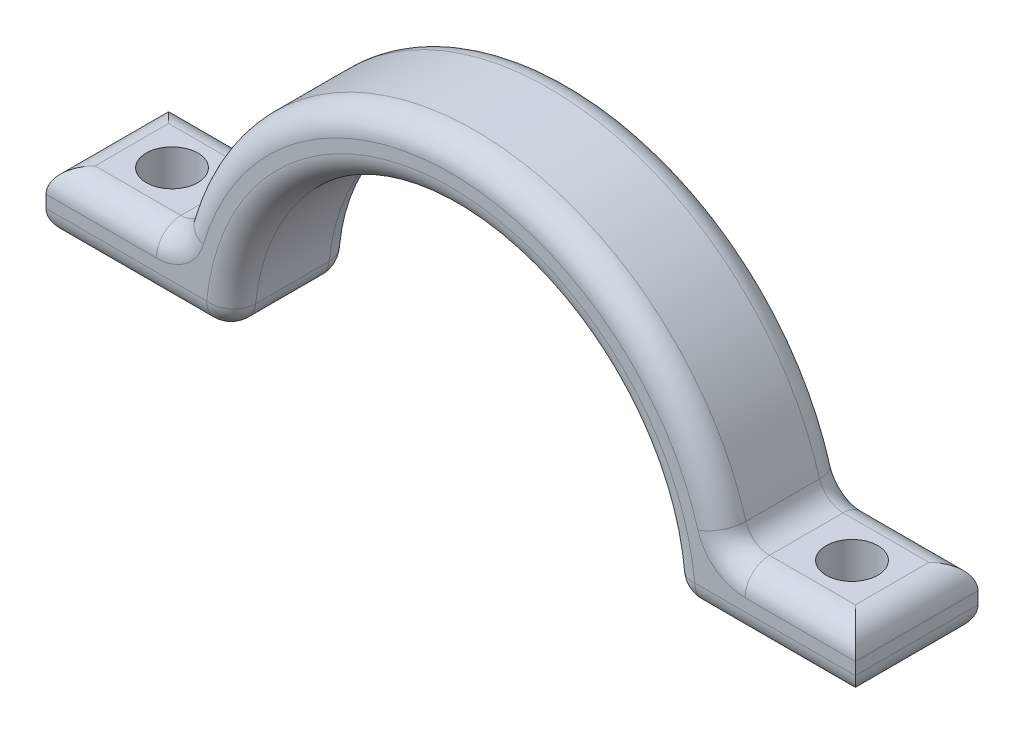
ISO-10303-21;
HEADER;
FILE_DESCRIPTION(('STEP AP214'),'2;1');
FILE_NAME('part.step','',(''),(''),'','','');
FILE_SCHEMA(('AUTOMOTIVE_DESIGN { 1 0 10303 214 1 1 1 1 }'));
ENDSEC;
DATA;
#1=APPLICATION_CONTEXT('core data for automotive mechanical design processes');
#2=APPLICATION_PROTOCOL_DEFINITION('international standard','automotive_design',2000,#1);
#3=PRODUCT_CONTEXT('',#1,'mechanical');
#4=PRODUCT('Part','Part','',(#3));
#5=PRODUCT_RELATED_PRODUCT_CATEGORY('part','',(#4));
#6=PRODUCT_DEFINITION_FORMATION('','',#4);
#7=PRODUCT_DEFINITION_CONTEXT('part definition',#1,'design');
#8=PRODUCT_DEFINITION('design','',#6,#7);
#9=PRODUCT_DEFINITION_SHAPE('','',#8);
#10=(LENGTH_UNIT() NAMED_UNIT(*) SI_UNIT(.MILLI.,.METRE.));
#11=(NAMED_UNIT(*) PLANE_ANGLE_UNIT() SI_UNIT($,.RADIAN.));
#12=(NAMED_UNIT(*) SI_UNIT($,.STERADIAN.) SOLID_ANGLE_UNIT());
#13=UNCERTAINTY_MEASURE_WITH_UNIT(LENGTH_MEASURE(1.E-05),#10,'distance_accuracy_value','');
#14=(GEOMETRIC_REPRESENTATION_CONTEXT(3) GLOBAL_UNCERTAINTY_ASSIGNED_CONTEXT((#13)) GLOBAL_UNIT_ASSIGNED_CONTEXT((#10,
#11,#12)) REPRESENTATION_CONTEXT('',''));
#15=CARTESIAN_POINT('',(0.,0.,0.));
#16=DIRECTION('',(0.,0.,1.));
#17=DIRECTION('',(1.,0.,0.));
#18=AXIS2_PLACEMENT_3D('',#15,#16,#17);
#19=CARTESIAN_POINT('',(0.,0.,10.));
#20=DIRECTION('',(0.,0.,-1.));
#21=DIRECTION('',(-1.,0.,0.));
#22=AXIS2_PLACEMENT_3D('',#19,#20,#21);
#23=CYLINDRICAL_SURFACE('',#22,23.);
#24=CARTESIAN_POINT('',(0.,0.,8.));
#25=DIRECTION('',(0.,0.,1.));
#26=DIRECTION('',(1.,0.,0.));
#27=AXIS2_PLACEMENT_3D('',#24,#25,#26);
#28=CIRCLE('',#27,23.);
#29=CARTESIAN_POINT('',(-22.08,6.44,8.));
#30=VERTEX_POINT('',#29);
#31=CARTESIAN_POINT('',(22.08,6.44,8.));
#32=VERTEX_POINT('',#31);
#33=EDGE_CURVE('E283',#30,#32,#28,.F.);
#34=ORIENTED_EDGE('',*,*,#33,.T.);
#35=DIRECTION('',(0.,0.,-1.));
#36=VECTOR('',#35,1.);
#37=CARTESIAN_POINT('',(22.08,6.44,10.));
#38=LINE('',#37,#36);
#39=CARTESIAN_POINT('',(22.08,6.44,2.));
#40=VERTEX_POINT('',#39);
#41=EDGE_CURVE('E286',#32,#40,#38,.T.);
#42=ORIENTED_EDGE('',*,*,#41,.T.);
#43=CARTESIAN_POINT('',(0.,0.,2.));
#44=DIRECTION('',(0.,0.,1.));
#45=DIRECTION('',(1.,0.,0.));
#46=AXIS2_PLACEMENT_3D('',#43,#44,#45);
#47=CIRCLE('',#46,23.);
#48=CARTESIAN_POINT('',(-22.08,6.44,2.));
#49=VERTEX_POINT('',#48);
#50=EDGE_CURVE('E281',#40,#49,#47,.T.);
#51=ORIENTED_EDGE('',*,*,#50,.T.);
#52=DIRECTION('',(0.,0.,-1.));
#53=VECTOR('',#52,1.);
#54=CARTESIAN_POINT('',(-22.08,6.44,10.));
#55=LINE('',#54,#53);
#56=EDGE_CURVE('E279',#49,#30,#55,.F.);
#57=ORIENTED_EDGE('',*,*,#56,.T.);
#58=EDGE_LOOP('',(#34,#42,#51,#57));
#59=FACE_BOUND('',#58,.T.);
#60=ADVANCED_FACE('F35',(#59),#23,.T.);
#61=CARTESIAN_POINT('',(-23.,0.,10.));
#62=DIRECTION('',(0.,1.,0.));
#63=DIRECTION('',(0.,0.,1.));
#64=AXIS2_PLACEMENT_3D('',#61,#62,#63);
#65=PLANE('',#64);
#66=DIRECTION('',(1.,0.,0.));
#67=VECTOR('',#66,1.);
#68=CARTESIAN_POINT('',(-23.,0.,2.));
#69=LINE('',#68,#67);
#70=CARTESIAN_POINT('',(-31.,0.,2.));
#71=VERTEX_POINT('',#70);
#72=CARTESIAN_POINT('',(-19.8997487421324,0.,2.));
#73=VERTEX_POINT('',#72);
#74=EDGE_CURVE('E274',#71,#73,#69,.T.);
#75=ORIENTED_EDGE('',*,*,#74,.T.);
#76=DIRECTION('',(0.,0.,-1.));
#77=VECTOR('',#76,1.);
#78=CARTESIAN_POINT('',(-19.8997487421324,0.,10.));
#79=LINE('',#78,#77);
#80=CARTESIAN_POINT('',(-19.8997487421324,0.,8.));
#81=VERTEX_POINT('',#80);
#82=EDGE_CURVE('E277',#73,#81,#79,.F.);
#83=ORIENTED_EDGE('',*,*,#82,.T.);
#84=DIRECTION('',(1.,0.,0.));
#85=VECTOR('',#84,1.);
#86=CARTESIAN_POINT('',(-33.,0.,8.));
#87=LINE('',#86,#85);
#88=CARTESIAN_POINT('',(-31.,0.,8.));
#89=VERTEX_POINT('',#88);
#90=EDGE_CURVE('E272',#81,#89,#87,.F.);
#91=ORIENTED_EDGE('',*,*,#90,.T.);
#92=DIRECTION('',(0.,0.,1.));
#93=VECTOR('',#92,1.);
#94=CARTESIAN_POINT('',(-31.,0.,0.));
#95=LINE('',#94,#93);
#96=EDGE_CURVE('E270',#89,#71,#95,.F.);
#97=ORIENTED_EDGE('',*,*,#96,.T.);
#98=EDGE_LOOP('',(#75,#83,#91,#97));
#99=FACE_BOUND('',#98,.T.);
#100=CARTESIAN_POINT('',(-27.7249721603218,0.,5.));
#101=DIRECTION('',(0.,1.,0.));
#102=DIRECTION('',(0.,0.,1.));
#103=AXIS2_PLACEMENT_3D('',#100,#101,#102);
#104=CIRCLE('',#103,2.1);
#105=CARTESIAN_POINT('',(-27.7249721603218,0.,7.1));
#106=VERTEX_POINT('',#105);
#107=EDGE_CURVE('E425',#106,#106,#104,.T.);
#108=ORIENTED_EDGE('',*,*,#107,.T.);
#109=EDGE_LOOP('',(#108));
#110=FACE_BOUND('',#109,.T.);
#111=ADVANCED_FACE('F395',(#99,#110),#65,.F.);
#112=CARTESIAN_POINT('',(0.,0.,10.));
#113=DIRECTION('',(0.,0.,-1.));
#114=DIRECTION('',(-1.,0.,0.));
#115=AXIS2_PLACEMENT_3D('',#112,#113,#114);
#116=CYLINDRICAL_SURFACE('',#115,18.);
#117=CARTESIAN_POINT('',(0.,0.,2.));
#118=DIRECTION('',(0.,0.,1.));
#119=DIRECTION('',(1.,0.,0.));
#120=AXIS2_PLACEMENT_3D('',#117,#118,#119);
#121=CIRCLE('',#120,18.);
#122=CARTESIAN_POINT('',(-17.9097738679192,1.8,2.));
#123=VERTEX_POINT('',#122);
#124=CARTESIAN_POINT('',(17.9097738679192,1.8,2.));
#125=VERTEX_POINT('',#124);
#126=EDGE_CURVE('E292',#123,#125,#121,.F.);
#127=ORIENTED_EDGE('',*,*,#126,.T.);
#128=DIRECTION('',(0.,0.,-1.));
#129=VECTOR('',#128,1.);
#130=CARTESIAN_POINT('',(17.9097738679192,1.8,10.));
#131=LINE('',#130,#129);
#132=CARTESIAN_POINT('',(17.9097738679192,1.8,8.));
#133=VERTEX_POINT('',#132);
#134=EDGE_CURVE('E52',#125,#133,#131,.F.);
#135=ORIENTED_EDGE('',*,*,#134,.T.);
#136=CARTESIAN_POINT('',(0.,0.,8.));
#137=DIRECTION('',(0.,0.,1.));
#138=DIRECTION('',(1.,0.,0.));
#139=AXIS2_PLACEMENT_3D('',#136,#137,#138);
#140=CIRCLE('',#139,18.);
#141=CARTESIAN_POINT('',(-17.9097738679192,1.8,8.));
#142=VERTEX_POINT('',#141);
#143=EDGE_CURVE('E290',#133,#142,#140,.T.);
#144=ORIENTED_EDGE('',*,*,#143,.T.);
#145=DIRECTION('',(0.,0.,-1.));
#146=VECTOR('',#145,1.);
#147=CARTESIAN_POINT('',(-17.9097738679192,1.8,10.));
#148=LINE('',#147,#146);
#149=EDGE_CURVE('E288',#142,#123,#148,.T.);
#150=ORIENTED_EDGE('',*,*,#149,.T.);
#151=EDGE_LOOP('',(#127,#135,#144,#150));
#152=FACE_BOUND('',#151,.T.);
#153=ADVANCED_FACE('F456',(#152),#116,.F.);
#154=CARTESIAN_POINT('',(18.,0.,10.));
#155=DIRECTION('',(0.,1.,0.));
#156=DIRECTION('',(0.,0.,1.));
#157=AXIS2_PLACEMENT_3D('',#154,#155,#156);
#158=PLANE('',#157);
#159=DIRECTION('',(1.,0.,0.));
#160=VECTOR('',#159,1.);
#161=CARTESIAN_POINT('',(18.,0.,2.));
#162=LINE('',#161,#160);
#163=CARTESIAN_POINT('',(19.8997487421324,0.,2.));
#164=VERTEX_POINT('',#163);
#165=CARTESIAN_POINT('',(31.,0.,2.));
#166=VERTEX_POINT('',#165);
#167=EDGE_CURVE('E263',#164,#166,#162,.T.);
#168=ORIENTED_EDGE('',*,*,#167,.T.);
#169=DIRECTION('',(0.,0.,1.));
#170=VECTOR('',#169,1.);
#171=CARTESIAN_POINT('',(31.,0.,10.));
#172=LINE('',#171,#170);
#173=CARTESIAN_POINT('',(31.,0.,8.));
#174=VERTEX_POINT('',#173);
#175=EDGE_CURVE('E268',#166,#174,#172,.T.);
#176=ORIENTED_EDGE('',*,*,#175,.T.);
#177=DIRECTION('',(1.,0.,0.));
#178=VECTOR('',#177,1.);
#179=CARTESIAN_POINT('',(18.,0.,8.));
#180=LINE('',#179,#178);
#181=CARTESIAN_POINT('',(19.8997487421324,0.,8.));
#182=VERTEX_POINT('',#181);
#183=EDGE_CURVE('E265',#174,#182,#180,.F.);
#184=ORIENTED_EDGE('',*,*,#183,.T.);
#185=DIRECTION('',(0.,0.,-1.));
#186=VECTOR('',#185,1.);
#187=CARTESIAN_POINT('',(19.8997487421324,0.,10.));
#188=LINE('',#187,#186);
#189=EDGE_CURVE('E261',#182,#164,#188,.T.);
#190=ORIENTED_EDGE('',*,*,#189,.T.);
#191=EDGE_LOOP('',(#168,#176,#184,#190));
#192=FACE_BOUND('',#191,.T.);
#193=CARTESIAN_POINT('',(27.7249721603218,0.,5.));
#194=DIRECTION('',(0.,1.,0.));
#195=DIRECTION('',(0.,0.,1.));
#196=AXIS2_PLACEMENT_3D('',#193,#194,#195);
#197=CIRCLE('',#196,2.1);
#198=CARTESIAN_POINT('',(27.7249721603218,0.,7.1));
#199=VERTEX_POINT('',#198);
#200=EDGE_CURVE('E440',#199,#199,#197,.F.);
#201=ORIENTED_EDGE('',*,*,#200,.F.);
#202=EDGE_LOOP('',(#201));
#203=FACE_BOUND('',#202,.T.);
#204=ADVANCED_FACE('F454',(#192,#203),#158,.F.);
#205=CARTESIAN_POINT('',(0.,0.,10.));
#206=DIRECTION('',(0.,0.,1.));
#207=DIRECTION('',(1.,0.,0.));
#208=AXIS2_PLACEMENT_3D('',#205,#206,#207);
#209=PLANE('',#208);
#210=DIRECTION('',(0.,1.,0.));
#211=VECTOR('',#210,1.);
#212=CARTESIAN_POINT('',(33.,0.,10.));
#213=LINE('',#212,#211);
#214=CARTESIAN_POINT('',(33.,2.,10.));
#215=VERTEX_POINT('',#214);
#216=CARTESIAN_POINT('',(33.,3.,10.));
#217=VERTEX_POINT('',#216);
#218=EDGE_CURVE('E438',#215,#217,#213,.T.);
#219=ORIENTED_EDGE('',*,*,#218,.T.);
#220=DIRECTION('',(1.,0.,0.));
#221=VECTOR('',#220,1.);
#222=CARTESIAN_POINT('',(22.4499443206436,3.,10.));
#223=LINE('',#222,#221);
#224=CARTESIAN_POINT('',(24.,3.,10.));
#225=VERTEX_POINT('',#224);
#226=EDGE_CURVE('E192',#217,#225,#223,.F.);
#227=ORIENTED_EDGE('',*,*,#226,.T.);
#228=CARTESIAN_POINT('',(24.,7.,10.));
#229=DIRECTION('',(0.,0.,1.));
#230=DIRECTION('',(1.,0.,0.));
#231=AXIS2_PLACEMENT_3D('',#228,#229,#230);
#232=CIRCLE('',#231,4.);
#233=CARTESIAN_POINT('',(20.16,5.88,10.));
#234=VERTEX_POINT('',#233);
#235=EDGE_CURVE('E230',#234,#225,#232,.T.);
#236=ORIENTED_EDGE('',*,*,#235,.F.);
#237=CARTESIAN_POINT('',(0.,0.,10.));
#238=DIRECTION('',(0.,0.,1.));
#239=DIRECTION('',(1.,0.,0.));
#240=AXIS2_PLACEMENT_3D('',#237,#238,#239);
#241=CIRCLE('',#240,21.);
#242=CARTESIAN_POINT('',(-20.16,5.88,10.));
#243=VERTEX_POINT('',#242);
#244=EDGE_CURVE('E226',#234,#243,#241,.T.);
#245=ORIENTED_EDGE('',*,*,#244,.T.);
#246=CARTESIAN_POINT('',(-24.,7.,10.));
#247=DIRECTION('',(0.,0.,1.));
#248=DIRECTION('',(1.,0.,0.));
#249=AXIS2_PLACEMENT_3D('',#246,#247,#248);
#250=CIRCLE('',#249,4.);
#251=CARTESIAN_POINT('',(-24.,3.,10.));
#252=VERTEX_POINT('',#251);
#253=EDGE_CURVE('E223',#252,#243,#250,.T.);
#254=ORIENTED_EDGE('',*,*,#253,.F.);
#255=DIRECTION('',(-1.,0.,0.));
#256=VECTOR('',#255,1.);
#257=CARTESIAN_POINT('',(0.,3.,10.));
#258=LINE('',#257,#256);
#259=CARTESIAN_POINT('',(-33.,3.,10.));
#260=VERTEX_POINT('',#259);
#261=EDGE_CURVE('E228',#252,#260,#258,.T.);
#262=ORIENTED_EDGE('',*,*,#261,.T.);
#263=DIRECTION('',(0.,1.,0.));
#264=VECTOR('',#263,1.);
#265=CARTESIAN_POINT('',(-33.,0.,10.));
#266=LINE('',#265,#264);
#267=CARTESIAN_POINT('',(-33.,2.,10.));
#268=VERTEX_POINT('',#267);
#269=EDGE_CURVE('E421',#268,#260,#266,.T.);
#270=ORIENTED_EDGE('',*,*,#269,.F.);
#271=DIRECTION('',(1.,0.,0.));
#272=VECTOR('',#271,1.);
#273=CARTESIAN_POINT('',(-18.,2.,10.));
#274=LINE('',#273,#272);
#275=CARTESIAN_POINT('',(-19.8997487421324,2.,10.));
#276=VERTEX_POINT('',#275);
#277=EDGE_CURVE('E218',#268,#276,#274,.T.);
#278=ORIENTED_EDGE('',*,*,#277,.T.);
#279=CARTESIAN_POINT('',(0.,0.,10.));
#280=DIRECTION('',(0.,0.,1.));
#281=DIRECTION('',(1.,0.,0.));
#282=AXIS2_PLACEMENT_3D('',#279,#280,#281);
#283=CIRCLE('',#282,20.);
#284=CARTESIAN_POINT('',(19.8997487421324,2.,10.));
#285=VERTEX_POINT('',#284);
#286=EDGE_CURVE('E213',#276,#285,#283,.F.);
#287=ORIENTED_EDGE('',*,*,#286,.T.);
#288=DIRECTION('',(1.,0.,0.));
#289=VECTOR('',#288,1.);
#290=CARTESIAN_POINT('',(33.,2.,10.));
#291=LINE('',#290,#289);
#292=EDGE_CURVE('E220',#285,#215,#291,.T.);
#293=ORIENTED_EDGE('',*,*,#292,.T.);
#294=EDGE_LOOP('',(#219,#227,#236,#245,#254,#262,#270,#278,#287,#293));
#295=FACE_BOUND('',#294,.T.);
#296=ADVANCED_FACE('F416',(#295),#209,.T.);
#297=CARTESIAN_POINT('',(0.,0.,0.));
#298=DIRECTION('',(0.,0.,1.));
#299=DIRECTION('',(1.,0.,0.));
#300=AXIS2_PLACEMENT_3D('',#297,#298,#299);
#301=PLANE('',#300);
#302=CARTESIAN_POINT('',(24.,7.,0.));
#303=DIRECTION('',(0.,0.,1.));
#304=DIRECTION('',(1.,0.,0.));
#305=AXIS2_PLACEMENT_3D('',#302,#303,#304);
#306=CIRCLE('',#305,4.);
#307=CARTESIAN_POINT('',(24.,3.,0.));
#308=VERTEX_POINT('',#307);
#309=CARTESIAN_POINT('',(20.16,5.88,0.));
#310=VERTEX_POINT('',#309);
#311=EDGE_CURVE('E249',#308,#310,#306,.F.);
#312=ORIENTED_EDGE('',*,*,#311,.F.);
#313=DIRECTION('',(1.,0.,0.));
#314=VECTOR('',#313,1.);
#315=CARTESIAN_POINT('',(0.,3.,0.));
#316=LINE('',#315,#314);
#317=CARTESIAN_POINT('',(33.,3.,0.));
#318=VERTEX_POINT('',#317);
#319=EDGE_CURVE('E259',#308,#318,#316,.T.);
#320=ORIENTED_EDGE('',*,*,#319,.T.);
#321=DIRECTION('',(0.,-1.,0.));
#322=VECTOR('',#321,1.);
#323=CARTESIAN_POINT('',(33.,0.,0.));
#324=LINE('',#323,#322);
#325=CARTESIAN_POINT('',(33.,2.,0.));
#326=VERTEX_POINT('',#325);
#327=EDGE_CURVE('E435',#318,#326,#324,.T.);
#328=ORIENTED_EDGE('',*,*,#327,.T.);
#329=DIRECTION('',(1.,0.,0.));
#330=VECTOR('',#329,1.);
#331=CARTESIAN_POINT('',(0.,2.,0.));
#332=LINE('',#331,#330);
#333=CARTESIAN_POINT('',(19.8997487421324,2.,0.));
#334=VERTEX_POINT('',#333);
#335=EDGE_CURVE('E247',#326,#334,#332,.F.);
#336=ORIENTED_EDGE('',*,*,#335,.T.);
#337=CARTESIAN_POINT('',(0.,0.,0.));
#338=DIRECTION('',(0.,0.,1.));
#339=DIRECTION('',(1.,0.,0.));
#340=AXIS2_PLACEMENT_3D('',#337,#338,#339);
#341=CIRCLE('',#340,20.);
#342=CARTESIAN_POINT('',(-19.8997487421324,2.,0.));
#343=VERTEX_POINT('',#342);
#344=EDGE_CURVE('E243',#334,#343,#341,.T.);
#345=ORIENTED_EDGE('',*,*,#344,.T.);
#346=DIRECTION('',(1.,0.,0.));
#347=VECTOR('',#346,1.);
#348=CARTESIAN_POINT('',(0.,2.,0.));
#349=LINE('',#348,#347);
#350=CARTESIAN_POINT('',(-33.,2.,0.));
#351=VERTEX_POINT('',#350);
#352=EDGE_CURVE('E245',#343,#351,#349,.F.);
#353=ORIENTED_EDGE('',*,*,#352,.T.);
#354=DIRECTION('',(0.,-1.,0.));
#355=VECTOR('',#354,1.);
#356=CARTESIAN_POINT('',(-33.,0.,0.));
#357=LINE('',#356,#355);
#358=CARTESIAN_POINT('',(-33.,3.,0.));
#359=VERTEX_POINT('',#358);
#360=EDGE_CURVE('E205',#359,#351,#357,.T.);
#361=ORIENTED_EDGE('',*,*,#360,.F.);
#362=DIRECTION('',(-1.,0.,0.));
#363=VECTOR('',#362,1.);
#364=CARTESIAN_POINT('',(-22.4499443206436,3.,0.));
#365=LINE('',#364,#363);
#366=CARTESIAN_POINT('',(-24.,3.,0.));
#367=VERTEX_POINT('',#366);
#368=EDGE_CURVE('E257',#359,#367,#365,.F.);
#369=ORIENTED_EDGE('',*,*,#368,.T.);
#370=CARTESIAN_POINT('',(-24.,7.,0.));
#371=DIRECTION('',(0.,0.,1.));
#372=DIRECTION('',(1.,0.,0.));
#373=AXIS2_PLACEMENT_3D('',#370,#371,#372);
#374=CIRCLE('',#373,4.);
#375=CARTESIAN_POINT('',(-20.16,5.88,0.));
#376=VERTEX_POINT('',#375);
#377=EDGE_CURVE('E254',#376,#367,#374,.F.);
#378=ORIENTED_EDGE('',*,*,#377,.F.);
#379=CARTESIAN_POINT('',(0.,0.,0.));
#380=DIRECTION('',(0.,0.,1.));
#381=DIRECTION('',(1.,0.,0.));
#382=AXIS2_PLACEMENT_3D('',#379,#380,#381);
#383=CIRCLE('',#382,21.);
#384=EDGE_CURVE('E252',#376,#310,#383,.F.);
#385=ORIENTED_EDGE('',*,*,#384,.T.);
#386=EDGE_LOOP('',(#312,#320,#328,#336,#345,#353,#361,#369,#378,#385));
#387=FACE_BOUND('',#386,.T.);
#388=ADVANCED_FACE('F463',(#387),#301,.F.);
#389=CARTESIAN_POINT('',(23.001,5.,10.));
#390=DIRECTION('',(0.,1.,0.));
#391=DIRECTION('',(0.,0.,1.));
#392=AXIS2_PLACEMENT_3D('',#389,#390,#391);
#393=PLANE('',#392);
#394=DIRECTION('',(-1.,0.,0.));
#395=VECTOR('',#394,1.);
#396=CARTESIAN_POINT('',(23.001,5.,8.));
#397=LINE('',#396,#395);
#398=CARTESIAN_POINT('',(-31.,5.,8.));
#399=VERTEX_POINT('',#398);
#400=CARTESIAN_POINT('',(-24.,5.,8.));
#401=VERTEX_POINT('',#400);
#402=EDGE_CURVE('E238',#399,#401,#397,.F.);
#403=ORIENTED_EDGE('',*,*,#402,.T.);
#404=DIRECTION('',(0.,0.,-1.));
#405=VECTOR('',#404,1.);
#406=CARTESIAN_POINT('',(-24.,5.,10.));
#407=LINE('',#406,#405);
#408=CARTESIAN_POINT('',(-24.,5.,2.));
#409=VERTEX_POINT('',#408);
#410=EDGE_CURVE('E241',#401,#409,#407,.T.);
#411=ORIENTED_EDGE('',*,*,#410,.T.);
#412=DIRECTION('',(-1.,0.,0.));
#413=VECTOR('',#412,1.);
#414=CARTESIAN_POINT('',(-33.,5.,2.));
#415=LINE('',#414,#413);
#416=CARTESIAN_POINT('',(-31.,5.,2.));
#417=VERTEX_POINT('',#416);
#418=EDGE_CURVE('E236',#409,#417,#415,.T.);
#419=ORIENTED_EDGE('',*,*,#418,.T.);
#420=DIRECTION('',(0.,0.,-1.));
#421=VECTOR('',#420,1.);
#422=CARTESIAN_POINT('',(-31.,5.,10.));
#423=LINE('',#422,#421);
#424=EDGE_CURVE('E234',#417,#399,#423,.F.);
#425=ORIENTED_EDGE('',*,*,#424,.T.);
#426=EDGE_LOOP('',(#403,#411,#419,#425));
#427=FACE_BOUND('',#426,.T.);
#428=CARTESIAN_POINT('',(-27.7249721603218,5.,5.));
#429=DIRECTION('',(0.,1.,0.));
#430=DIRECTION('',(0.,0.,1.));
#431=AXIS2_PLACEMENT_3D('',#428,#429,#430);
#432=CIRCLE('',#431,2.1);
#433=CARTESIAN_POINT('',(-27.7249721603218,5.,7.1));
#434=VERTEX_POINT('',#433);
#435=EDGE_CURVE('E430',#434,#434,#432,.T.);
#436=ORIENTED_EDGE('',*,*,#435,.F.);
#437=EDGE_LOOP('',(#436));
#438=FACE_BOUND('',#437,.T.);
#439=ADVANCED_FACE('F657',(#427,#438),#393,.T.);
#440=CARTESIAN_POINT('',(-33.,0.,0.));
#441=DIRECTION('',(-1.,0.,0.));
#442=DIRECTION('',(0.,0.,1.));
#443=AXIS2_PLACEMENT_3D('',#440,#441,#442);
#444=PLANE('',#443);
#445=ORIENTED_EDGE('',*,*,#269,.T.);
#446=DIRECTION('',(0.,0.,-1.));
#447=VECTOR('',#446,1.);
#448=CARTESIAN_POINT('',(-33.,3.,0.));
#449=LINE('',#448,#447);
#450=EDGE_CURVE('E11',#260,#359,#449,.T.);
#451=ORIENTED_EDGE('',*,*,#450,.T.);
#452=ORIENTED_EDGE('',*,*,#360,.T.);
#453=DIRECTION('',(0.,0.,1.));
#454=VECTOR('',#453,1.);
#455=CARTESIAN_POINT('',(-33.,2.,10.));
#456=LINE('',#455,#454);
#457=EDGE_CURVE('E44',#351,#268,#456,.T.);
#458=ORIENTED_EDGE('',*,*,#457,.T.);
#459=EDGE_LOOP('',(#445,#451,#452,#458));
#460=FACE_BOUND('',#459,.T.);
#461=ADVANCED_FACE('F650',(#460),#444,.T.);
#462=CARTESIAN_POINT('',(-27.7249721603218,-5.,5.));
#463=DIRECTION('',(0.,1.,0.));
#464=DIRECTION('',(0.,0.,1.));
#465=AXIS2_PLACEMENT_3D('',#462,#463,#464);
#466=CYLINDRICAL_SURFACE('',#465,2.1);
#467=ORIENTED_EDGE('',*,*,#435,.T.);
#468=EDGE_LOOP('',(#467));
#469=FACE_BOUND('',#468,.T.);
#470=ORIENTED_EDGE('',*,*,#107,.F.);
#471=EDGE_LOOP('',(#470));
#472=FACE_BOUND('',#471,.T.);
#473=ADVANCED_FACE('F643',(#469,#472),#466,.F.);
#474=CARTESIAN_POINT('',(-33.001,5.,10.));
#475=DIRECTION('',(0.,-1.,0.));
#476=DIRECTION('',(0.,0.,-1.));
#477=AXIS2_PLACEMENT_3D('',#474,#475,#476);
#478=PLANE('',#477);
#479=DIRECTION('',(1.,0.,0.));
#480=VECTOR('',#479,1.);
#481=CARTESIAN_POINT('',(-33.001,5.,2.));
#482=LINE('',#481,#480);
#483=CARTESIAN_POINT('',(31.,5.,2.));
#484=VERTEX_POINT('',#483);
#485=CARTESIAN_POINT('',(24.,5.,2.));
#486=VERTEX_POINT('',#485);
#487=EDGE_CURVE('E204',#484,#486,#482,.F.);
#488=ORIENTED_EDGE('',*,*,#487,.T.);
#489=DIRECTION('',(0.,0.,1.));
#490=VECTOR('',#489,1.);
#491=CARTESIAN_POINT('',(24.,5.,10.));
#492=LINE('',#491,#490);
#493=CARTESIAN_POINT('',(24.,5.,8.));
#494=VERTEX_POINT('',#493);
#495=EDGE_CURVE('E210',#486,#494,#492,.T.);
#496=ORIENTED_EDGE('',*,*,#495,.T.);
#497=DIRECTION('',(1.,0.,0.));
#498=VECTOR('',#497,1.);
#499=CARTESIAN_POINT('',(33.,5.,8.));
#500=LINE('',#499,#498);
#501=CARTESIAN_POINT('',(31.,5.,8.));
#502=VERTEX_POINT('',#501);
#503=EDGE_CURVE('E190',#494,#502,#500,.T.);
#504=ORIENTED_EDGE('',*,*,#503,.T.);
#505=DIRECTION('',(0.,0.,-1.));
#506=VECTOR('',#505,1.);
#507=CARTESIAN_POINT('',(31.,5.,0.));
#508=LINE('',#507,#506);
#509=EDGE_CURVE('E198',#502,#484,#508,.T.);
#510=ORIENTED_EDGE('',*,*,#509,.T.);
#511=EDGE_LOOP('',(#488,#496,#504,#510));
#512=FACE_BOUND('',#511,.T.);
#513=CARTESIAN_POINT('',(27.7249721603218,5.,5.));
#514=DIRECTION('',(0.,-1.,0.));
#515=DIRECTION('',(0.,0.,1.));
#516=AXIS2_PLACEMENT_3D('',#513,#514,#515);
#517=CIRCLE('',#516,2.1);
#518=CARTESIAN_POINT('',(27.7249721603218,5.,7.1));
#519=VERTEX_POINT('',#518);
#520=EDGE_CURVE('E339',#519,#519,#517,.T.);
#521=ORIENTED_EDGE('',*,*,#520,.T.);
#522=EDGE_LOOP('',(#521));
#523=FACE_BOUND('',#522,.T.);
#524=ADVANCED_FACE('F207',(#512,#523),#478,.F.);
#525=CARTESIAN_POINT('',(33.,0.,0.));
#526=DIRECTION('',(1.,0.,0.));
#527=DIRECTION('',(0.,0.,1.));
#528=AXIS2_PLACEMENT_3D('',#525,#526,#527);
#529=PLANE('',#528);
#530=ORIENTED_EDGE('',*,*,#327,.F.);
#531=DIRECTION('',(0.,0.,-1.));
#532=VECTOR('',#531,1.);
#533=CARTESIAN_POINT('',(33.,3.,10.));
#534=LINE('',#533,#532);
#535=EDGE_CURVE('E297',#318,#217,#534,.F.);
#536=ORIENTED_EDGE('',*,*,#535,.T.);
#537=ORIENTED_EDGE('',*,*,#218,.F.);
#538=DIRECTION('',(0.,0.,1.));
#539=VECTOR('',#538,1.);
#540=CARTESIAN_POINT('',(33.,2.,0.));
#541=LINE('',#540,#539);
#542=EDGE_CURVE('E295',#215,#326,#541,.F.);
#543=ORIENTED_EDGE('',*,*,#542,.T.);
#544=EDGE_LOOP('',(#530,#536,#537,#543));
#545=FACE_BOUND('',#544,.T.);
#546=ADVANCED_FACE('F450',(#545),#529,.T.);
#547=CARTESIAN_POINT('',(27.7249721603218,-5.,5.));
#548=DIRECTION('',(0.,1.,0.));
#549=DIRECTION('',(0.,0.,1.));
#550=AXIS2_PLACEMENT_3D('',#547,#548,#549);
#551=CYLINDRICAL_SURFACE('',#550,2.1);
#552=ORIENTED_EDGE('',*,*,#520,.F.);
#553=EDGE_LOOP('',(#552));
#554=FACE_BOUND('',#553,.T.);
#555=ORIENTED_EDGE('',*,*,#200,.T.);
#556=EDGE_LOOP('',(#555));
#557=FACE_BOUND('',#556,.T.);
#558=ADVANCED_FACE('F446',(#554,#557),#551,.F.);
#559=CARTESIAN_POINT('',(23.001,3.,2.));
#560=DIRECTION('',(1.,0.,0.));
#561=DIRECTION('',(0.,0.,-1.));
#562=AXIS2_PLACEMENT_3D('',#559,#560,#561);
#563=CYLINDRICAL_SURFACE('',#562,2.);
#564=CARTESIAN_POINT('',(-24.,3.,2.));
#565=DIRECTION('',(1.,0.,0.));
#566=DIRECTION('',(0.,0.,-1.));
#567=AXIS2_PLACEMENT_3D('',#564,#565,#566);
#568=CIRCLE('',#567,2.);
#569=EDGE_CURVE('E333',#367,#409,#568,.T.);
#570=ORIENTED_EDGE('',*,*,#569,.F.);
#571=ORIENTED_EDGE('',*,*,#368,.F.);
#572=CARTESIAN_POINT('',(-31.,3.,2.));
#573=DIRECTION('',(0.707106781186547,0.,-0.707106781186547));
#574=DIRECTION('',(-0.707106781186547,0.,-0.707106781186547));
#575=AXIS2_PLACEMENT_3D('',#572,#573,#574);
#576=ELLIPSE('',#575,2.82842712474619,2.);
#577=EDGE_CURVE('E336',#417,#359,#576,.F.);
#578=ORIENTED_EDGE('',*,*,#577,.F.);
#579=ORIENTED_EDGE('',*,*,#418,.F.);
#580=EDGE_LOOP('',(#570,#571,#578,#579));
#581=FACE_BOUND('',#580,.T.);
#582=ADVANCED_FACE('F449',(#581),#563,.T.);
#583=CARTESIAN_POINT('',(-31.,3.,0.));
#584=DIRECTION('',(0.,0.,-1.));
#585=DIRECTION('',(-1.,0.,0.));
#586=AXIS2_PLACEMENT_3D('',#583,#584,#585);
#587=CYLINDRICAL_SURFACE('',#586,2.);
#588=ORIENTED_EDGE('',*,*,#577,.T.);
#589=ORIENTED_EDGE('',*,*,#450,.F.);
#590=CARTESIAN_POINT('',(-31.,3.,8.));
#591=DIRECTION('',(-0.707106781186547,0.,-0.707106781186547));
#592=DIRECTION('',(0.707106781186547,0.,-0.707106781186547));
#593=AXIS2_PLACEMENT_3D('',#590,#591,#592);
#594=ELLIPSE('',#593,2.82842712474619,2.);
#595=EDGE_CURVE('E330',#399,#260,#594,.F.);
#596=ORIENTED_EDGE('',*,*,#595,.F.);
#597=ORIENTED_EDGE('',*,*,#424,.F.);
#598=EDGE_LOOP('',(#588,#589,#596,#597));
#599=FACE_BOUND('',#598,.T.);
#600=ADVANCED_FACE('F518',(#599),#587,.T.);
#601=CARTESIAN_POINT('',(-24.,7.,2.));
#602=DIRECTION('',(0.,0.,1.));
#603=DIRECTION('',(1.,0.,0.));
#604=AXIS2_PLACEMENT_3D('',#601,#602,#603);
#605=TOROIDAL_SURFACE('',#604,4.,2.);
#606=ORIENTED_EDGE('',*,*,#377,.T.);
#607=ORIENTED_EDGE('',*,*,#569,.T.);
#608=CARTESIAN_POINT('',(-24.,7.,2.));
#609=DIRECTION('',(0.,0.,1.));
#610=DIRECTION('',(1.,0.,0.));
#611=AXIS2_PLACEMENT_3D('',#608,#609,#610);
#612=CIRCLE('',#611,2.);
#613=EDGE_CURVE('E327',#49,#409,#612,.F.);
#614=ORIENTED_EDGE('',*,*,#613,.F.);
#615=CARTESIAN_POINT('',(-20.16,5.88,2.));
#616=DIRECTION('',(-0.28,-0.96,0.));
#617=DIRECTION('',(0.96,-0.28,0.));
#618=AXIS2_PLACEMENT_3D('',#615,#616,#617);
#619=CIRCLE('',#618,2.);
#620=EDGE_CURVE('E324',#376,#49,#619,.F.);
#621=ORIENTED_EDGE('',*,*,#620,.F.);
#622=EDGE_LOOP('',(#606,#607,#614,#621));
#623=FACE_BOUND('',#622,.T.);
#624=ADVANCED_FACE('F514',(#623),#605,.T.);
#625=CARTESIAN_POINT('',(0.,3.,8.));
#626=DIRECTION('',(-1.,0.,0.));
#627=DIRECTION('',(0.,0.,1.));
#628=AXIS2_PLACEMENT_3D('',#625,#626,#627);
#629=CYLINDRICAL_SURFACE('',#628,2.);
#630=ORIENTED_EDGE('',*,*,#595,.T.);
#631=ORIENTED_EDGE('',*,*,#261,.F.);
#632=CARTESIAN_POINT('',(-24.,3.,8.));
#633=DIRECTION('',(1.,0.,0.));
#634=DIRECTION('',(0.,0.,-1.));
#635=AXIS2_PLACEMENT_3D('',#632,#633,#634);
#636=CIRCLE('',#635,2.);
#637=EDGE_CURVE('E321',#401,#252,#636,.T.);
#638=ORIENTED_EDGE('',*,*,#637,.F.);
#639=ORIENTED_EDGE('',*,*,#402,.F.);
#640=EDGE_LOOP('',(#630,#631,#638,#639));
#641=FACE_BOUND('',#640,.T.);
#642=ADVANCED_FACE('F510',(#641),#629,.T.);
#643=CARTESIAN_POINT('',(-24.,7.,10.));
#644=DIRECTION('',(0.,0.,-1.));
#645=DIRECTION('',(-1.,0.,0.));
#646=AXIS2_PLACEMENT_3D('',#643,#644,#645);
#647=CYLINDRICAL_SURFACE('',#646,2.);
#648=ORIENTED_EDGE('',*,*,#613,.T.);
#649=ORIENTED_EDGE('',*,*,#410,.F.);
#650=CARTESIAN_POINT('',(-24.,7.,8.));
#651=DIRECTION('',(0.,0.,1.));
#652=DIRECTION('',(1.,0.,0.));
#653=AXIS2_PLACEMENT_3D('',#650,#651,#652);
#654=CIRCLE('',#653,2.);
#655=EDGE_CURVE('E319',#30,#401,#654,.F.);
#656=ORIENTED_EDGE('',*,*,#655,.F.);
#657=ORIENTED_EDGE('',*,*,#56,.F.);
#658=EDGE_LOOP('',(#648,#649,#656,#657));
#659=FACE_BOUND('',#658,.T.);
#660=ADVANCED_FACE('F506',(#659),#647,.F.);
#661=CARTESIAN_POINT('',(0.,0.,2.));
#662=DIRECTION('',(0.,0.,1.));
#663=DIRECTION('',(1.,0.,0.));
#664=AXIS2_PLACEMENT_3D('',#661,#662,#663);
#665=TOROIDAL_SURFACE('',#664,21.,2.);
#666=ORIENTED_EDGE('',*,*,#620,.T.);
#667=ORIENTED_EDGE('',*,*,#50,.F.);
#668=CARTESIAN_POINT('',(20.16,5.88,2.));
#669=DIRECTION('',(0.28,-0.96,0.));
#670=DIRECTION('',(0.96,0.28,0.));
#671=AXIS2_PLACEMENT_3D('',#668,#669,#670);
#672=CIRCLE('',#671,2.);
#673=EDGE_CURVE('E316',#310,#40,#672,.T.);
#674=ORIENTED_EDGE('',*,*,#673,.F.);
#675=ORIENTED_EDGE('',*,*,#384,.F.);
#676=EDGE_LOOP('',(#666,#667,#674,#675));
#677=FACE_BOUND('',#676,.T.);
#678=ADVANCED_FACE('F502',(#677),#665,.T.);
#679=CARTESIAN_POINT('',(-24.,7.,8.));
#680=DIRECTION('',(0.,0.,1.));
#681=DIRECTION('',(1.,0.,0.));
#682=AXIS2_PLACEMENT_3D('',#679,#680,#681);
#683=TOROIDAL_SURFACE('',#682,4.,2.);
#684=ORIENTED_EDGE('',*,*,#637,.T.);
#685=ORIENTED_EDGE('',*,*,#253,.T.);
#686=CARTESIAN_POINT('',(-20.16,5.88,8.));
#687=DIRECTION('',(-0.28,-0.96,0.));
#688=DIRECTION('',(0.96,-0.28,0.));
#689=AXIS2_PLACEMENT_3D('',#686,#687,#688);
#690=CIRCLE('',#689,2.);
#691=EDGE_CURVE('E313',#30,#243,#690,.F.);
#692=ORIENTED_EDGE('',*,*,#691,.F.);
#693=ORIENTED_EDGE('',*,*,#655,.T.);
#694=EDGE_LOOP('',(#684,#685,#692,#693));
#695=FACE_BOUND('',#694,.T.);
#696=ADVANCED_FACE('F498',(#695),#683,.T.);
#697=CARTESIAN_POINT('',(24.,7.,2.));
#698=DIRECTION('',(0.,0.,1.));
#699=DIRECTION('',(1.,0.,0.));
#700=AXIS2_PLACEMENT_3D('',#697,#698,#699);
#701=TOROIDAL_SURFACE('',#700,4.,2.);
#702=ORIENTED_EDGE('',*,*,#311,.T.);
#703=ORIENTED_EDGE('',*,*,#673,.T.);
#704=CARTESIAN_POINT('',(24.,7.,2.));
#705=DIRECTION('',(0.,0.,1.));
#706=DIRECTION('',(1.,0.,0.));
#707=AXIS2_PLACEMENT_3D('',#704,#705,#706);
#708=CIRCLE('',#707,2.);
#709=EDGE_CURVE('E310',#486,#40,#708,.F.);
#710=ORIENTED_EDGE('',*,*,#709,.F.);
#711=CARTESIAN_POINT('',(24.,3.,2.));
#712=DIRECTION('',(-1.,0.,0.));
#713=DIRECTION('',(0.,0.,1.));
#714=AXIS2_PLACEMENT_3D('',#711,#712,#713);
#715=CIRCLE('',#714,2.);
#716=EDGE_CURVE('E307',#308,#486,#715,.F.);
#717=ORIENTED_EDGE('',*,*,#716,.F.);
#718=EDGE_LOOP('',(#702,#703,#710,#717));
#719=FACE_BOUND('',#718,.T.);
#720=ADVANCED_FACE('F494',(#719),#701,.T.);
#721=CARTESIAN_POINT('',(0.,0.,8.));
#722=DIRECTION('',(0.,0.,1.));
#723=DIRECTION('',(1.,0.,0.));
#724=AXIS2_PLACEMENT_3D('',#721,#722,#723);
#725=TOROIDAL_SURFACE('',#724,21.,2.);
#726=ORIENTED_EDGE('',*,*,#691,.T.);
#727=ORIENTED_EDGE('',*,*,#244,.F.);
#728=CARTESIAN_POINT('',(20.16,5.88,8.));
#729=DIRECTION('',(0.28,-0.96,0.));
#730=DIRECTION('',(0.96,0.28,0.));
#731=AXIS2_PLACEMENT_3D('',#728,#729,#730);
#732=CIRCLE('',#731,2.);
#733=EDGE_CURVE('E304',#32,#234,#732,.T.);
#734=ORIENTED_EDGE('',*,*,#733,.F.);
#735=ORIENTED_EDGE('',*,*,#33,.F.);
#736=EDGE_LOOP('',(#726,#727,#734,#735));
#737=FACE_BOUND('',#736,.T.);
#738=ADVANCED_FACE('F490',(#737),#725,.T.);
#739=CARTESIAN_POINT('',(24.,7.,10.));
#740=DIRECTION('',(0.,0.,-1.));
#741=DIRECTION('',(-1.,0.,0.));
#742=AXIS2_PLACEMENT_3D('',#739,#740,#741);
#743=CYLINDRICAL_SURFACE('',#742,2.);
#744=ORIENTED_EDGE('',*,*,#709,.T.);
#745=ORIENTED_EDGE('',*,*,#41,.F.);
#746=CARTESIAN_POINT('',(24.,7.,8.));
#747=DIRECTION('',(0.,0.,1.));
#748=DIRECTION('',(1.,0.,0.));
#749=AXIS2_PLACEMENT_3D('',#746,#747,#748);
#750=CIRCLE('',#749,2.);
#751=EDGE_CURVE('E302',#494,#32,#750,.F.);
#752=ORIENTED_EDGE('',*,*,#751,.F.);
#753=ORIENTED_EDGE('',*,*,#495,.F.);
#754=EDGE_LOOP('',(#744,#745,#752,#753));
#755=FACE_BOUND('',#754,.T.);
#756=ADVANCED_FACE('F486',(#755),#743,.F.);
#757=CARTESIAN_POINT('',(0.,3.,2.));
#758=DIRECTION('',(1.,0.,0.));
#759=DIRECTION('',(0.,0.,-1.));
#760=AXIS2_PLACEMENT_3D('',#757,#758,#759);
#761=CYLINDRICAL_SURFACE('',#760,2.);
#762=ORIENTED_EDGE('',*,*,#716,.T.);
#763=ORIENTED_EDGE('',*,*,#487,.F.);
#764=CARTESIAN_POINT('',(31.,3.,2.));
#765=DIRECTION('',(0.707106781186547,0.,0.707106781186547));
#766=DIRECTION('',(-0.707106781186547,0.,0.707106781186547));
#767=AXIS2_PLACEMENT_3D('',#764,#765,#766);
#768=ELLIPSE('',#767,2.82842712474619,2.);
#769=EDGE_CURVE('E201',#318,#484,#768,.T.);
#770=ORIENTED_EDGE('',*,*,#769,.F.);
#771=ORIENTED_EDGE('',*,*,#319,.F.);
#772=EDGE_LOOP('',(#762,#763,#770,#771));
#773=FACE_BOUND('',#772,.T.);
#774=ADVANCED_FACE('F482',(#773),#761,.T.);
#775=CARTESIAN_POINT('',(24.,7.,8.));
#776=DIRECTION('',(0.,0.,1.));
#777=DIRECTION('',(1.,0.,0.));
#778=AXIS2_PLACEMENT_3D('',#775,#776,#777);
#779=TOROIDAL_SURFACE('',#778,4.,2.);
#780=ORIENTED_EDGE('',*,*,#733,.T.);
#781=ORIENTED_EDGE('',*,*,#235,.T.);
#782=CARTESIAN_POINT('',(24.,3.,8.));
#783=DIRECTION('',(-1.,0.,0.));
#784=DIRECTION('',(0.,0.,1.));
#785=AXIS2_PLACEMENT_3D('',#782,#783,#784);
#786=CIRCLE('',#785,2.);
#787=EDGE_CURVE('E195',#494,#225,#786,.F.);
#788=ORIENTED_EDGE('',*,*,#787,.F.);
#789=ORIENTED_EDGE('',*,*,#751,.T.);
#790=EDGE_LOOP('',(#780,#781,#788,#789));
#791=FACE_BOUND('',#790,.T.);
#792=ADVANCED_FACE('F479',(#791),#779,.T.);
#793=CARTESIAN_POINT('',(31.,3.,10.));
#794=DIRECTION('',(0.,0.,1.));
#795=DIRECTION('',(1.,0.,0.));
#796=AXIS2_PLACEMENT_3D('',#793,#794,#795);
#797=CYLINDRICAL_SURFACE('',#796,2.);
#798=ORIENTED_EDGE('',*,*,#769,.T.);
#799=ORIENTED_EDGE('',*,*,#509,.F.);
#800=CARTESIAN_POINT('',(31.,3.,8.));
#801=DIRECTION('',(-0.707106781186547,0.,0.707106781186547));
#802=DIRECTION('',(0.707106781186547,0.,0.707106781186547));
#803=AXIS2_PLACEMENT_3D('',#800,#801,#802);
#804=ELLIPSE('',#803,2.82842712474619,2.);
#805=EDGE_CURVE('E186',#217,#502,#804,.T.);
#806=ORIENTED_EDGE('',*,*,#805,.F.);
#807=ORIENTED_EDGE('',*,*,#535,.F.);
#808=EDGE_LOOP('',(#798,#799,#806,#807));
#809=FACE_BOUND('',#808,.T.);
#810=ADVANCED_FACE('F199',(#809),#797,.T.);
#811=CARTESIAN_POINT('',(-33.001,3.,8.));
#812=DIRECTION('',(-1.,0.,0.));
#813=DIRECTION('',(0.,0.,1.));
#814=AXIS2_PLACEMENT_3D('',#811,#812,#813);
#815=CYLINDRICAL_SURFACE('',#814,2.);
#816=ORIENTED_EDGE('',*,*,#787,.T.);
#817=ORIENTED_EDGE('',*,*,#226,.F.);
#818=ORIENTED_EDGE('',*,*,#805,.T.);
#819=ORIENTED_EDGE('',*,*,#503,.F.);
#820=EDGE_LOOP('',(#816,#817,#818,#819));
#821=FACE_BOUND('',#820,.T.);
#822=ADVANCED_FACE('F188',(#821),#815,.T.);
#823=CARTESIAN_POINT('',(-23.,2.,2.));
#824=DIRECTION('',(1.,0.,0.));
#825=DIRECTION('',(0.,0.,-1.));
#826=AXIS2_PLACEMENT_3D('',#823,#824,#825);
#827=CYLINDRICAL_SURFACE('',#826,2.);
#828=CARTESIAN_POINT('',(-19.8997487421324,2.,2.));
#829=DIRECTION('',(1.,0.,0.));
#830=DIRECTION('',(0.,0.,-1.));
#831=AXIS2_PLACEMENT_3D('',#828,#829,#830);
#832=CIRCLE('',#831,2.);
#833=EDGE_CURVE('E378',#73,#343,#832,.T.);
#834=ORIENTED_EDGE('',*,*,#833,.F.);
#835=ORIENTED_EDGE('',*,*,#74,.F.);
#836=CARTESIAN_POINT('',(-31.,2.,2.));
#837=DIRECTION('',(0.707106781186547,0.,-0.707106781186547));
#838=DIRECTION('',(-0.707106781186547,0.,-0.707106781186547));
#839=AXIS2_PLACEMENT_3D('',#836,#837,#838);
#840=ELLIPSE('',#839,2.82842712474619,2.);
#841=EDGE_CURVE('E39',#351,#71,#840,.F.);
#842=ORIENTED_EDGE('',*,*,#841,.F.);
#843=ORIENTED_EDGE('',*,*,#352,.F.);
#844=EDGE_LOOP('',(#834,#835,#842,#843));
#845=FACE_BOUND('',#844,.T.);
#846=ADVANCED_FACE('F37',(#845),#827,.T.);
#847=CARTESIAN_POINT('',(-31.,2.,0.));
#848=DIRECTION('',(0.,0.,-1.));
#849=DIRECTION('',(-1.,0.,0.));
#850=AXIS2_PLACEMENT_3D('',#847,#848,#849);
#851=CYLINDRICAL_SURFACE('',#850,2.);
#852=ORIENTED_EDGE('',*,*,#841,.T.);
#853=ORIENTED_EDGE('',*,*,#96,.F.);
#854=CARTESIAN_POINT('',(-31.,2.,8.));
#855=DIRECTION('',(-0.707106781186547,0.,-0.707106781186547));
#856=DIRECTION('',(0.707106781186547,0.,-0.707106781186547));
#857=AXIS2_PLACEMENT_3D('',#854,#855,#856);
#858=ELLIPSE('',#857,2.82842712474619,2.);
#859=EDGE_CURVE('E373',#268,#89,#858,.F.);
#860=ORIENTED_EDGE('',*,*,#859,.F.);
#861=ORIENTED_EDGE('',*,*,#457,.F.);
#862=EDGE_LOOP('',(#852,#853,#860,#861));
#863=FACE_BOUND('',#862,.T.);
#864=ADVANCED_FACE('F389',(#863),#851,.T.);
#865=CARTESIAN_POINT('',(-19.8997487421324,2.,2.));
#866=DIRECTION('',(0.,0.,-1.));
#867=DIRECTION('',(-1.,0.,0.));
#868=AXIS2_PLACEMENT_3D('',#865,#866,#867);
#869=SPHERICAL_SURFACE('',#868,2.);
#870=CARTESIAN_POINT('',(-19.8997487421324,2.,2.));
#871=DIRECTION('',(-0.0999999999999998,-0.99498743710662,0.));
#872=DIRECTION('',(0.99498743710662,-0.0999999999999998,0.));
#873=AXIS2_PLACEMENT_3D('',#870,#871,#872);
#874=CIRCLE('',#873,2.);
#875=EDGE_CURVE('E370',#123,#343,#874,.F.);
#876=ORIENTED_EDGE('',*,*,#875,.F.);
#877=CARTESIAN_POINT('',(-19.8997487421324,2.,2.));
#878=DIRECTION('',(0.,0.,-1.));
#879=DIRECTION('',(-1.,0.,0.));
#880=AXIS2_PLACEMENT_3D('',#877,#878,#879);
#881=CIRCLE('',#880,2.);
#882=EDGE_CURVE('E376',#73,#123,#881,.F.);
#883=ORIENTED_EDGE('',*,*,#882,.F.);
#884=ORIENTED_EDGE('',*,*,#833,.T.);
#885=EDGE_LOOP('',(#876,#883,#884));
#886=FACE_BOUND('',#885,.T.);
#887=ADVANCED_FACE('F561',(#886),#869,.T.);
#888=CARTESIAN_POINT('',(-19.8997487421324,2.,10.));
#889=DIRECTION('',(0.,0.,-1.));
#890=DIRECTION('',(-1.,0.,0.));
#891=AXIS2_PLACEMENT_3D('',#888,#889,#890);
#892=CYLINDRICAL_SURFACE('',#891,2.);
#893=ORIENTED_EDGE('',*,*,#882,.T.);
#894=ORIENTED_EDGE('',*,*,#149,.F.);
#895=CARTESIAN_POINT('',(-19.8997487421324,2.,8.));
#896=DIRECTION('',(0.,0.,1.));
#897=DIRECTION('',(1.,0.,0.));
#898=AXIS2_PLACEMENT_3D('',#895,#896,#897);
#899=CIRCLE('',#898,2.);
#900=EDGE_CURVE('E367',#81,#142,#899,.T.);
#901=ORIENTED_EDGE('',*,*,#900,.F.);
#902=ORIENTED_EDGE('',*,*,#82,.F.);
#903=EDGE_LOOP('',(#893,#894,#901,#902));
#904=FACE_BOUND('',#903,.T.);
#905=ADVANCED_FACE('F406',(#904),#892,.T.);
#906=CARTESIAN_POINT('',(0.,2.,8.));
#907=DIRECTION('',(-1.,0.,0.));
#908=DIRECTION('',(0.,0.,1.));
#909=AXIS2_PLACEMENT_3D('',#906,#907,#908);
#910=CYLINDRICAL_SURFACE('',#909,2.);
#911=ORIENTED_EDGE('',*,*,#859,.T.);
#912=ORIENTED_EDGE('',*,*,#90,.F.);
#913=CARTESIAN_POINT('',(-19.8997487421324,2.,8.));
#914=DIRECTION('',(1.,0.,0.));
#915=DIRECTION('',(0.,1.,0.));
#916=AXIS2_PLACEMENT_3D('',#913,#914,#915);
#917=CIRCLE('',#916,2.);
#918=EDGE_CURVE('E364',#276,#81,#917,.T.);
#919=ORIENTED_EDGE('',*,*,#918,.F.);
#920=ORIENTED_EDGE('',*,*,#277,.F.);
#921=EDGE_LOOP('',(#911,#912,#919,#920));
#922=FACE_BOUND('',#921,.T.);
#923=ADVANCED_FACE('F401',(#922),#910,.T.);
#924=CARTESIAN_POINT('',(0.,0.,2.));
#925=DIRECTION('',(0.,0.,1.));
#926=DIRECTION('',(1.,0.,0.));
#927=AXIS2_PLACEMENT_3D('',#924,#925,#926);
#928=TOROIDAL_SURFACE('',#927,20.,2.);
#929=ORIENTED_EDGE('',*,*,#875,.T.);
#930=ORIENTED_EDGE('',*,*,#344,.F.);
#931=CARTESIAN_POINT('',(19.8997487421324,2.,2.));
#932=DIRECTION('',(0.1,-0.99498743710662,0.));
#933=DIRECTION('',(0.99498743710662,0.1,0.));
#934=AXIS2_PLACEMENT_3D('',#931,#932,#933);
#935=CIRCLE('',#934,2.);
#936=EDGE_CURVE('E361',#125,#334,#935,.T.);
#937=ORIENTED_EDGE('',*,*,#936,.F.);
#938=ORIENTED_EDGE('',*,*,#126,.F.);
#939=EDGE_LOOP('',(#929,#930,#937,#938));
#940=FACE_BOUND('',#939,.T.);
#941=ADVANCED_FACE('F553',(#940),#928,.T.);
#942=CARTESIAN_POINT('',(-19.8997487421324,2.,8.));
#943=DIRECTION('',(0.,0.,1.));
#944=DIRECTION('',(1.,0.,0.));
#945=AXIS2_PLACEMENT_3D('',#942,#943,#944);
#946=SPHERICAL_SURFACE('',#945,2.);
#947=ORIENTED_EDGE('',*,*,#918,.T.);
#948=ORIENTED_EDGE('',*,*,#900,.T.);
#949=CARTESIAN_POINT('',(-19.8997487421324,2.,8.));
#950=DIRECTION('',(-0.1,-0.99498743710662,0.));
#951=DIRECTION('',(0.99498743710662,-0.1,0.));
#952=AXIS2_PLACEMENT_3D('',#949,#950,#951);
#953=CIRCLE('',#952,2.);
#954=EDGE_CURVE('E356',#276,#142,#953,.F.);
#955=ORIENTED_EDGE('',*,*,#954,.F.);
#956=EDGE_LOOP('',(#947,#948,#955));
#957=FACE_BOUND('',#956,.T.);
#958=ADVANCED_FACE('F408',(#957),#946,.T.);
#959=CARTESIAN_POINT('',(19.8997487421324,2.,2.));
#960=DIRECTION('',(0.,0.,-1.));
#961=DIRECTION('',(-1.,0.,0.));
#962=AXIS2_PLACEMENT_3D('',#959,#960,#961);
#963=SPHERICAL_SURFACE('',#962,2.);
#964=CARTESIAN_POINT('',(19.8997487421324,2.,2.));
#965=DIRECTION('',(-1.,0.,0.));
#966=DIRECTION('',(0.,-1.,0.));
#967=AXIS2_PLACEMENT_3D('',#964,#965,#966);
#968=CIRCLE('',#967,2.);
#969=EDGE_CURVE('E353',#164,#334,#968,.F.);
#970=ORIENTED_EDGE('',*,*,#969,.F.);
#971=CARTESIAN_POINT('',(19.8997487421324,2.,2.));
#972=DIRECTION('',(0.,0.,-1.));
#973=DIRECTION('',(-1.,0.,0.));
#974=AXIS2_PLACEMENT_3D('',#971,#972,#973);
#975=CIRCLE('',#974,2.);
#976=EDGE_CURVE('E359',#125,#164,#975,.F.);
#977=ORIENTED_EDGE('',*,*,#976,.F.);
#978=ORIENTED_EDGE('',*,*,#936,.T.);
#979=EDGE_LOOP('',(#970,#977,#978));
#980=FACE_BOUND('',#979,.T.);
#981=ADVANCED_FACE('F547',(#980),#963,.T.);
#982=CARTESIAN_POINT('',(19.8997487421324,2.,10.));
#983=DIRECTION('',(0.,0.,-1.));
#984=DIRECTION('',(-1.,0.,0.));
#985=AXIS2_PLACEMENT_3D('',#982,#983,#984);
#986=CYLINDRICAL_SURFACE('',#985,2.);
#987=ORIENTED_EDGE('',*,*,#976,.T.);
#988=ORIENTED_EDGE('',*,*,#189,.F.);
#989=CARTESIAN_POINT('',(19.8997487421324,2.,8.));
#990=DIRECTION('',(0.,0.,1.));
#991=DIRECTION('',(1.,0.,0.));
#992=AXIS2_PLACEMENT_3D('',#989,#990,#991);
#993=CIRCLE('',#992,2.);
#994=EDGE_CURVE('E350',#133,#182,#993,.T.);
#995=ORIENTED_EDGE('',*,*,#994,.F.);
#996=ORIENTED_EDGE('',*,*,#134,.F.);
#997=EDGE_LOOP('',(#987,#988,#995,#996));
#998=FACE_BOUND('',#997,.T.);
#999=ADVANCED_FACE('F544',(#998),#986,.T.);
#1000=CARTESIAN_POINT('',(0.,0.,8.));
#1001=DIRECTION('',(0.,0.,1.));
#1002=DIRECTION('',(1.,0.,0.));
#1003=AXIS2_PLACEMENT_3D('',#1000,#1001,#1002);
#1004=TOROIDAL_SURFACE('',#1003,20.,2.);
#1005=ORIENTED_EDGE('',*,*,#954,.T.);
#1006=ORIENTED_EDGE('',*,*,#143,.F.);
#1007=CARTESIAN_POINT('',(19.8997487421324,2.,8.));
#1008=DIRECTION('',(0.0999999999999998,-0.99498743710662,0.));
#1009=DIRECTION('',(0.99498743710662,0.0999999999999998,0.));
#1010=AXIS2_PLACEMENT_3D('',#1007,#1008,#1009);
#1011=CIRCLE('',#1010,2.);
#1012=EDGE_CURVE('E347',#285,#133,#1011,.T.);
#1013=ORIENTED_EDGE('',*,*,#1012,.F.);
#1014=ORIENTED_EDGE('',*,*,#286,.F.);
#1015=EDGE_LOOP('',(#1005,#1006,#1013,#1014));
#1016=FACE_BOUND('',#1015,.T.);
#1017=ADVANCED_FACE('F412',(#1016),#1004,.T.);
#1018=CARTESIAN_POINT('',(18.,2.,2.));
#1019=DIRECTION('',(1.,0.,0.));
#1020=DIRECTION('',(0.,0.,-1.));
#1021=AXIS2_PLACEMENT_3D('',#1018,#1019,#1020);
#1022=CYLINDRICAL_SURFACE('',#1021,2.);
#1023=ORIENTED_EDGE('',*,*,#969,.T.);
#1024=ORIENTED_EDGE('',*,*,#335,.F.);
#1025=CARTESIAN_POINT('',(31.,2.,2.));
#1026=DIRECTION('',(-0.707106781186547,0.,-0.707106781186547));
#1027=DIRECTION('',(0.707106781186547,0.,-0.707106781186547));
#1028=AXIS2_PLACEMENT_3D('',#1025,#1026,#1027);
#1029=ELLIPSE('',#1028,2.82842712474619,2.);
#1030=EDGE_CURVE('E344',#166,#326,#1029,.F.);
#1031=ORIENTED_EDGE('',*,*,#1030,.F.);
#1032=ORIENTED_EDGE('',*,*,#167,.F.);
#1033=EDGE_LOOP('',(#1023,#1024,#1031,#1032));
#1034=FACE_BOUND('',#1033,.T.);
#1035=ADVANCED_FACE('F537',(#1034),#1022,.T.);
#1036=CARTESIAN_POINT('',(19.8997487421324,2.,8.));
#1037=DIRECTION('',(0.,0.,1.));
#1038=DIRECTION('',(1.,0.,0.));
#1039=AXIS2_PLACEMENT_3D('',#1036,#1037,#1038);
#1040=SPHERICAL_SURFACE('',#1039,2.);
#1041=ORIENTED_EDGE('',*,*,#1012,.T.);
#1042=ORIENTED_EDGE('',*,*,#994,.T.);
#1043=CARTESIAN_POINT('',(19.8997487421324,2.,8.));
#1044=DIRECTION('',(-1.,0.,0.));
#1045=DIRECTION('',(0.,0.,1.));
#1046=AXIS2_PLACEMENT_3D('',#1043,#1044,#1045);
#1047=CIRCLE('',#1046,2.);
#1048=EDGE_CURVE('E342',#285,#182,#1047,.F.);
#1049=ORIENTED_EDGE('',*,*,#1048,.F.);
#1050=EDGE_LOOP('',(#1041,#1042,#1049));
#1051=FACE_BOUND('',#1050,.T.);
#1052=ADVANCED_FACE('F533',(#1051),#1040,.T.);
#1053=CARTESIAN_POINT('',(31.,2.,10.));
#1054=DIRECTION('',(0.,0.,-1.));
#1055=DIRECTION('',(-1.,0.,0.));
#1056=AXIS2_PLACEMENT_3D('',#1053,#1054,#1055);
#1057=CYLINDRICAL_SURFACE('',#1056,2.);
#1058=ORIENTED_EDGE('',*,*,#1030,.T.);
#1059=ORIENTED_EDGE('',*,*,#542,.F.);
#1060=CARTESIAN_POINT('',(31.,2.,8.));
#1061=DIRECTION('',(0.707106781186547,0.,-0.707106781186547));
#1062=DIRECTION('',(-0.707106781186547,0.,-0.707106781186547));
#1063=AXIS2_PLACEMENT_3D('',#1060,#1061,#1062);
#1064=ELLIPSE('',#1063,2.82842712474619,2.);
#1065=EDGE_CURVE('E340',#174,#215,#1064,.F.);
#1066=ORIENTED_EDGE('',*,*,#1065,.F.);
#1067=ORIENTED_EDGE('',*,*,#175,.F.);
#1068=EDGE_LOOP('',(#1058,#1059,#1066,#1067));
#1069=FACE_BOUND('',#1068,.T.);
#1070=ADVANCED_FACE('F529',(#1069),#1057,.T.);
#1071=CARTESIAN_POINT('',(0.,2.,8.));
#1072=DIRECTION('',(-1.,0.,0.));
#1073=DIRECTION('',(0.,0.,1.));
#1074=AXIS2_PLACEMENT_3D('',#1071,#1072,#1073);
#1075=CYLINDRICAL_SURFACE('',#1074,2.);
#1076=ORIENTED_EDGE('',*,*,#1048,.T.);
#1077=ORIENTED_EDGE('',*,*,#183,.F.);
#1078=ORIENTED_EDGE('',*,*,#1065,.T.);
#1079=ORIENTED_EDGE('',*,*,#292,.F.);
#1080=EDGE_LOOP('',(#1076,#1077,#1078,#1079));
#1081=FACE_BOUND('',#1080,.T.);
#1082=ADVANCED_FACE('F526',(#1081),#1075,.T.);
#1083=CLOSED_SHELL('',(#60,#111,#153,#204,#296,#388,#439,#461,#473,#524,#546,#558,#582,#600,
#624,#642,#660,#678,#696,#720,#738,#756,#774,#792,#810,#822,#846,#864,#887,#905,#923,#941,#958,
#981,#999,#1017,#1035,#1052,#1070,#1082));
#1084=MANIFOLD_SOLID_BREP('B2',#1083);
#1085=ADVANCED_BREP_SHAPE_REPRESENTATION('',(#18,#1084),#14);
#1086=SHAPE_DEFINITION_REPRESENTATION(#9,#1085);
ENDSEC;
END-ISO-10303-21;
